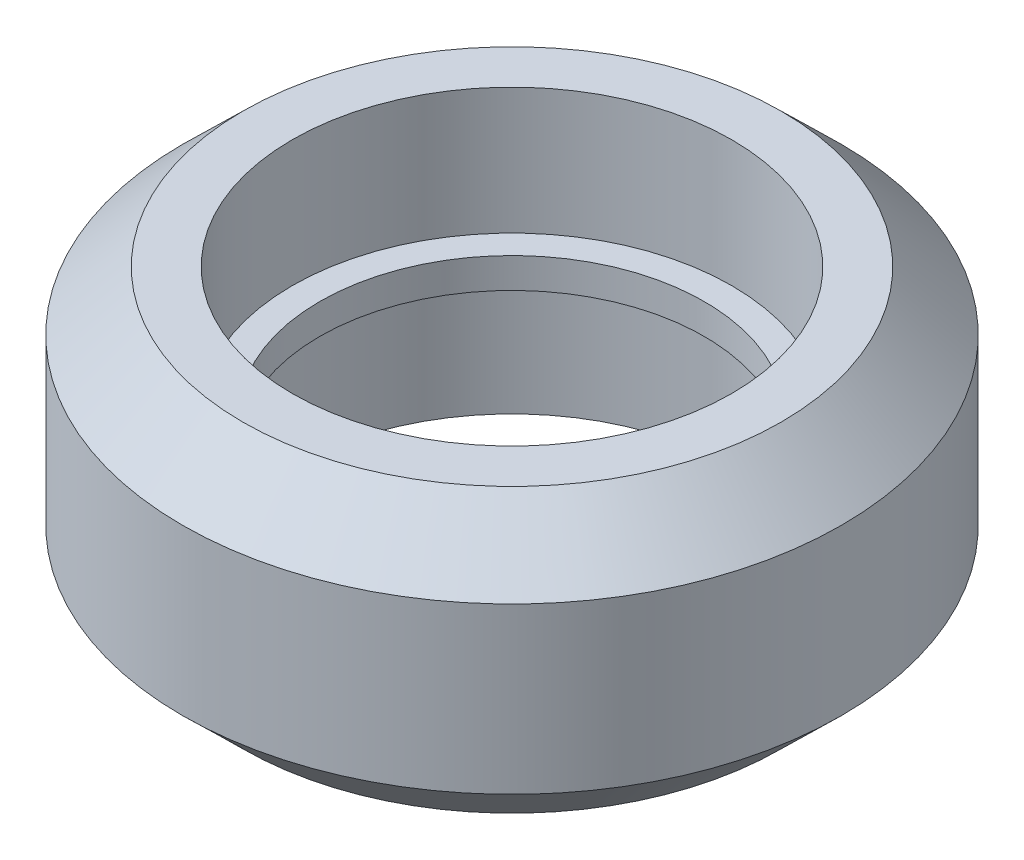
ISO-10303-21;
HEADER;
FILE_DESCRIPTION(('STEP AP214'),'2;1');
FILE_NAME('part.step','',(''),(''),'','','');
FILE_SCHEMA(('AUTOMOTIVE_DESIGN { 1 0 10303 214 1 1 1 1 }'));
ENDSEC;
DATA;
#1=APPLICATION_CONTEXT('core data for automotive mechanical design processes');
#2=APPLICATION_PROTOCOL_DEFINITION('international standard','automotive_design',2000,#1);
#3=PRODUCT_CONTEXT('',#1,'mechanical');
#4=PRODUCT('Part','Part','',(#3));
#5=PRODUCT_RELATED_PRODUCT_CATEGORY('part','',(#4));
#6=PRODUCT_DEFINITION_FORMATION('','',#4);
#7=PRODUCT_DEFINITION_CONTEXT('part definition',#1,'design');
#8=PRODUCT_DEFINITION('design','',#6,#7);
#9=PRODUCT_DEFINITION_SHAPE('','',#8);
#10=(LENGTH_UNIT() NAMED_UNIT(*) SI_UNIT(.MILLI.,.METRE.));
#11=(NAMED_UNIT(*) PLANE_ANGLE_UNIT() SI_UNIT($,.RADIAN.));
#12=(NAMED_UNIT(*) SI_UNIT($,.STERADIAN.) SOLID_ANGLE_UNIT());
#13=UNCERTAINTY_MEASURE_WITH_UNIT(LENGTH_MEASURE(1.E-05),#10,'distance_accuracy_value','');
#14=(GEOMETRIC_REPRESENTATION_CONTEXT(3) GLOBAL_UNCERTAINTY_ASSIGNED_CONTEXT((#13)) GLOBAL_UNIT_ASSIGNED_CONTEXT((#10,
#11,#12)) REPRESENTATION_CONTEXT('',''));
#15=CARTESIAN_POINT('',(0.,0.,0.));
#16=DIRECTION('',(0.,0.,1.));
#17=DIRECTION('',(1.,0.,0.));
#18=AXIS2_PLACEMENT_3D('',#15,#16,#17);
#19=CARTESIAN_POINT('',(6.35888258013483,3.25798729371791,-1.06642978596483));
#20=DIRECTION('',(0.,1.,0.));
#21=DIRECTION('',(1.,0.,0.));
#22=AXIS2_PLACEMENT_3D('',#19,#20,#21);
#23=PLANE('',#22);
#24=CARTESIAN_POINT('',(-1.64111741986517,3.25798729371791,-1.06642978596483));
#25=DIRECTION('',(0.,-1.,0.));
#26=DIRECTION('',(1.,0.,0.));
#27=AXIS2_PLACEMENT_3D('',#24,#25,#26);
#28=CIRCLE('',#27,8.);
#29=CARTESIAN_POINT('',(6.35888258013483,3.25798729371791,-1.06642978596483));
#30=VERTEX_POINT('',#29);
#31=CARTESIAN_POINT('',(-9.64111741986517,3.25798729371791,-1.06642978596483));
#32=VERTEX_POINT('',#31);
#33=EDGE_CURVE('E39',#30,#32,#28,.T.);
#34=ORIENTED_EDGE('',*,*,#33,.F.);
#35=CARTESIAN_POINT('',(-1.64111741986517,3.25798729371791,-1.06642978596483));
#36=DIRECTION('',(0.,-1.,0.));
#37=DIRECTION('',(1.,0.,0.));
#38=AXIS2_PLACEMENT_3D('',#35,#36,#37);
#39=CIRCLE('',#38,8.);
#40=EDGE_CURVE('E164',#32,#30,#39,.T.);
#41=ORIENTED_EDGE('',*,*,#40,.F.);
#42=EDGE_LOOP('',(#34,#41));
#43=FACE_BOUND('',#42,.T.);
#44=CARTESIAN_POINT('',(-1.64111741986517,3.25798729371791,-1.06642978596483));
#45=DIRECTION('',(0.,-1.,0.));
#46=DIRECTION('',(1.,0.,0.));
#47=AXIS2_PLACEMENT_3D('',#44,#45,#46);
#48=CIRCLE('',#47,7.);
#49=CARTESIAN_POINT('',(5.35888258013483,3.25798729371791,-1.06642978596483));
#50=VERTEX_POINT('',#49);
#51=CARTESIAN_POINT('',(-8.64111741986517,3.25798729371791,-1.06642978596483));
#52=VERTEX_POINT('',#51);
#53=EDGE_CURVE('E10',#50,#52,#48,.T.);
#54=ORIENTED_EDGE('',*,*,#53,.T.);
#55=CARTESIAN_POINT('',(-1.64111741986517,3.25798729371791,-1.06642978596483));
#56=DIRECTION('',(0.,-1.,0.));
#57=DIRECTION('',(1.,0.,0.));
#58=AXIS2_PLACEMENT_3D('',#55,#56,#57);
#59=CIRCLE('',#58,7.);
#60=EDGE_CURVE('E26',#52,#50,#59,.T.);
#61=ORIENTED_EDGE('',*,*,#60,.T.);
#62=EDGE_LOOP('',(#54,#61));
#63=FACE_BOUND('',#62,.T.);
#64=ADVANCED_FACE('F16',(#43,#63),#23,.T.);
#65=CARTESIAN_POINT('',(-1.64111741986517,5.55798729371791,-1.06642978596483));
#66=DIRECTION('',(0.,-1.,0.));
#67=DIRECTION('',(1.,0.,0.));
#68=AXIS2_PLACEMENT_3D('',#65,#66,#67);
#69=CYLINDRICAL_SURFACE('',#68,8.);
#70=ORIENTED_EDGE('',*,*,#33,.T.);
#71=DIRECTION('',(0.,1.,0.));
#72=VECTOR('',#71,1.);
#73=CARTESIAN_POINT('',(-9.64111741986517,5.55798729371791,-1.06642978596483));
#74=LINE('',#73,#72);
#75=CARTESIAN_POINT('',(-9.64111741986517,7.85798729371791,-1.06642978596483));
#76=VERTEX_POINT('',#75);
#77=EDGE_CURVE('E167',#32,#76,#74,.T.);
#78=ORIENTED_EDGE('',*,*,#77,.T.);
#79=CARTESIAN_POINT('',(-1.64111741986517,7.85798729371791,-1.06642978596483));
#80=DIRECTION('',(0.,-1.,0.));
#81=DIRECTION('',(1.,0.,0.));
#82=AXIS2_PLACEMENT_3D('',#79,#80,#81);
#83=CIRCLE('',#82,8.);
#84=CARTESIAN_POINT('',(6.35888258013483,7.85798729371791,-1.06642978596483));
#85=VERTEX_POINT('',#84);
#86=EDGE_CURVE('E162',#85,#76,#83,.T.);
#87=ORIENTED_EDGE('',*,*,#86,.F.);
#88=CARTESIAN_POINT('',(-1.64111741986517,7.85798729371791,-1.06642978596483));
#89=DIRECTION('',(0.,-1.,0.));
#90=DIRECTION('',(1.,0.,0.));
#91=AXIS2_PLACEMENT_3D('',#88,#89,#90);
#92=CIRCLE('',#91,8.);
#93=EDGE_CURVE('E165',#76,#85,#92,.T.);
#94=ORIENTED_EDGE('',*,*,#93,.F.);
#95=ORIENTED_EDGE('',*,*,#77,.F.);
#96=ORIENTED_EDGE('',*,*,#40,.T.);
#97=EDGE_LOOP('',(#70,#78,#87,#94,#95,#96));
#98=FACE_BOUND('',#97,.T.);
#99=ADVANCED_FACE('F211',(#98),#69,.F.);
#100=CARTESIAN_POINT('',(8.15888258013483,7.85798729371791,-1.06642978596483));
#101=DIRECTION('',(0.,1.,0.));
#102=DIRECTION('',(1.,0.,0.));
#103=AXIS2_PLACEMENT_3D('',#100,#101,#102);
#104=PLANE('',#103);
#105=CARTESIAN_POINT('',(-1.64111741986517,7.85798729371791,-1.06642978596483));
#106=DIRECTION('',(0.,-1.,0.));
#107=DIRECTION('',(1.,0.,0.));
#108=AXIS2_PLACEMENT_3D('',#105,#106,#107);
#109=CIRCLE('',#108,9.8);
#110=CARTESIAN_POINT('',(8.15888258013483,7.85798729371791,-1.06642978596483));
#111=VERTEX_POINT('',#110);
#112=CARTESIAN_POINT('',(-11.4411174198652,7.85798729371791,-1.06642978596483));
#113=VERTEX_POINT('',#112);
#114=EDGE_CURVE('E150',#111,#113,#109,.T.);
#115=ORIENTED_EDGE('',*,*,#114,.F.);
#116=CARTESIAN_POINT('',(-1.64111741986517,7.85798729371791,-1.06642978596483));
#117=DIRECTION('',(0.,-1.,0.));
#118=DIRECTION('',(1.,0.,0.));
#119=AXIS2_PLACEMENT_3D('',#116,#117,#118);
#120=CIRCLE('',#119,9.8);
#121=EDGE_CURVE('E153',#113,#111,#120,.T.);
#122=ORIENTED_EDGE('',*,*,#121,.F.);
#123=EDGE_LOOP('',(#115,#122));
#124=FACE_BOUND('',#123,.T.);
#125=ORIENTED_EDGE('',*,*,#86,.T.);
#126=ORIENTED_EDGE('',*,*,#93,.T.);
#127=EDGE_LOOP('',(#125,#126));
#128=FACE_BOUND('',#127,.T.);
#129=ADVANCED_FACE('F214',(#124,#128),#104,.T.);
#130=CARTESIAN_POINT('',(-1.64111741986517,6.78298729371791,-1.06642978596483));
#131=DIRECTION('',(0.,-1.,0.));
#132=DIRECTION('',(1.,0.,0.));
#133=AXIS2_PLACEMENT_3D('',#130,#131,#132);
#134=CONICAL_SURFACE('',#133,10.9,0.796891910112479);
#135=CARTESIAN_POINT('',(-1.64111741986517,5.70798729371791,-1.06642978596483));
#136=DIRECTION('',(0.,-1.,0.));
#137=DIRECTION('',(1.,0.,0.));
#138=AXIS2_PLACEMENT_3D('',#135,#136,#137);
#139=CIRCLE('',#138,12.);
#140=CARTESIAN_POINT('',(10.3588825801348,5.70798729371791,-1.06642978596483));
#141=VERTEX_POINT('',#140);
#142=CARTESIAN_POINT('',(-13.6411174198652,5.70798729371791,-1.06642978596483));
#143=VERTEX_POINT('',#142);
#144=EDGE_CURVE('E200',#141,#143,#139,.T.);
#145=ORIENTED_EDGE('',*,*,#144,.F.);
#146=CARTESIAN_POINT('',(-1.64111741986517,5.70798729371791,-1.06642978596483));
#147=DIRECTION('',(0.,-1.,0.));
#148=DIRECTION('',(1.,0.,0.));
#149=AXIS2_PLACEMENT_3D('',#146,#147,#148);
#150=CIRCLE('',#149,12.);
#151=EDGE_CURVE('E19',#143,#141,#150,.T.);
#152=ORIENTED_EDGE('',*,*,#151,.F.);
#153=DIRECTION('',(0.715187202401024,0.698932947801001,0.));
#154=VECTOR('',#153,1.);
#155=CARTESIAN_POINT('',(-12.5411174198652,6.78298729371791,-1.06642978596483));
#156=LINE('',#155,#154);
#157=EDGE_CURVE('E174',#143,#113,#156,.T.);
#158=ORIENTED_EDGE('',*,*,#157,.T.);
#159=ORIENTED_EDGE('',*,*,#121,.T.);
#160=ORIENTED_EDGE('',*,*,#114,.T.);
#161=ORIENTED_EDGE('',*,*,#157,.F.);
#162=EDGE_LOOP('',(#145,#152,#158,#159,#160,#161));
#163=FACE_BOUND('',#162,.T.);
#164=ADVANCED_FACE('F216',(#163),#134,.T.);
#165=CARTESIAN_POINT('',(-1.64111741986517,2.70798729371791,-1.06642978596483));
#166=DIRECTION('',(0.,-1.,0.));
#167=DIRECTION('',(1.,0.,0.));
#168=AXIS2_PLACEMENT_3D('',#165,#166,#167);
#169=CYLINDRICAL_SURFACE('',#168,12.);
#170=CARTESIAN_POINT('',(-1.64111741986517,-0.292012706282094,-1.06642978596483));
#171=DIRECTION('',(0.,-1.,0.));
#172=DIRECTION('',(1.,0.,0.));
#173=AXIS2_PLACEMENT_3D('',#170,#171,#172);
#174=CIRCLE('',#173,12.);
#175=CARTESIAN_POINT('',(10.3588825801348,-0.292012706282094,-1.06642978596483));
#176=VERTEX_POINT('',#175);
#177=CARTESIAN_POINT('',(-13.6411174198652,-0.292012706282094,-1.06642978596483));
#178=VERTEX_POINT('',#177);
#179=EDGE_CURVE('E155',#176,#178,#174,.T.);
#180=ORIENTED_EDGE('',*,*,#179,.F.);
#181=CARTESIAN_POINT('',(-1.64111741986517,-0.292012706282094,-1.06642978596483));
#182=DIRECTION('',(0.,-1.,0.));
#183=DIRECTION('',(1.,0.,0.));
#184=AXIS2_PLACEMENT_3D('',#181,#182,#183);
#185=CIRCLE('',#184,12.);
#186=EDGE_CURVE('E158',#178,#176,#185,.T.);
#187=ORIENTED_EDGE('',*,*,#186,.F.);
#188=DIRECTION('',(0.,1.,0.));
#189=VECTOR('',#188,1.);
#190=CARTESIAN_POINT('',(-13.6411174198652,2.70798729371791,-1.06642978596483));
#191=LINE('',#190,#189);
#192=EDGE_CURVE('E154',#178,#143,#191,.T.);
#193=ORIENTED_EDGE('',*,*,#192,.T.);
#194=ORIENTED_EDGE('',*,*,#151,.T.);
#195=ORIENTED_EDGE('',*,*,#144,.T.);
#196=ORIENTED_EDGE('',*,*,#192,.F.);
#197=EDGE_LOOP('',(#180,#187,#193,#194,#195,#196));
#198=FACE_BOUND('',#197,.T.);
#199=ADVANCED_FACE('F223',(#198),#169,.T.);
#200=CARTESIAN_POINT('',(-1.64111741986517,-1.36701270628209,-1.06642978596483));
#201=DIRECTION('',(0.,1.,0.));
#202=DIRECTION('',(1.,0.,0.));
#203=AXIS2_PLACEMENT_3D('',#200,#201,#202);
#204=CONICAL_SURFACE('',#203,10.9,0.796891910112479);
#205=CARTESIAN_POINT('',(-1.64111741986517,-2.44201270628209,-1.06642978596483));
#206=DIRECTION('',(0.,-1.,0.));
#207=DIRECTION('',(1.,0.,0.));
#208=AXIS2_PLACEMENT_3D('',#205,#206,#207);
#209=CIRCLE('',#208,9.8);
#210=CARTESIAN_POINT('',(8.15888258013483,-2.44201270628209,-1.06642978596483));
#211=VERTEX_POINT('',#210);
#212=CARTESIAN_POINT('',(-11.4411174198652,-2.44201270628209,-1.06642978596483));
#213=VERTEX_POINT('',#212);
#214=EDGE_CURVE('E118',#211,#213,#209,.T.);
#215=ORIENTED_EDGE('',*,*,#214,.F.);
#216=CARTESIAN_POINT('',(-1.64111741986517,-2.44201270628209,-1.06642978596483));
#217=DIRECTION('',(0.,-1.,0.));
#218=DIRECTION('',(1.,0.,0.));
#219=AXIS2_PLACEMENT_3D('',#216,#217,#218);
#220=CIRCLE('',#219,9.8);
#221=EDGE_CURVE('E122',#213,#211,#220,.T.);
#222=ORIENTED_EDGE('',*,*,#221,.F.);
#223=DIRECTION('',(-0.715187202401024,0.698932947801001,0.));
#224=VECTOR('',#223,1.);
#225=CARTESIAN_POINT('',(-12.5411174198652,-1.36701270628209,-1.06642978596483));
#226=LINE('',#225,#224);
#227=EDGE_CURVE('E178',#213,#178,#226,.T.);
#228=ORIENTED_EDGE('',*,*,#227,.T.);
#229=ORIENTED_EDGE('',*,*,#186,.T.);
#230=ORIENTED_EDGE('',*,*,#179,.T.);
#231=ORIENTED_EDGE('',*,*,#227,.F.);
#232=EDGE_LOOP('',(#215,#222,#228,#229,#230,#231));
#233=FACE_BOUND('',#232,.T.);
#234=ADVANCED_FACE('F247',(#233),#204,.T.);
#235=CARTESIAN_POINT('',(6.35888258013483,-2.44201270628209,-1.06642978596483));
#236=DIRECTION('',(0.,-1.,0.));
#237=DIRECTION('',(0.,0.,-1.));
#238=AXIS2_PLACEMENT_3D('',#235,#236,#237);
#239=PLANE('',#238);
#240=ORIENTED_EDGE('',*,*,#214,.T.);
#241=ORIENTED_EDGE('',*,*,#221,.T.);
#242=EDGE_LOOP('',(#240,#241));
#243=FACE_BOUND('',#242,.T.);
#244=CARTESIAN_POINT('',(-1.64111741986517,-2.44201270628209,-1.06642978596483));
#245=DIRECTION('',(0.,-1.,0.));
#246=DIRECTION('',(1.,0.,0.));
#247=AXIS2_PLACEMENT_3D('',#244,#245,#246);
#248=CIRCLE('',#247,8.);
#249=CARTESIAN_POINT('',(6.35888258013483,-2.44201270628209,-1.06642978596483));
#250=VERTEX_POINT('',#249);
#251=CARTESIAN_POINT('',(-9.64111741986517,-2.44201270628209,-1.06642978596483));
#252=VERTEX_POINT('',#251);
#253=EDGE_CURVE('E128',#250,#252,#248,.T.);
#254=ORIENTED_EDGE('',*,*,#253,.F.);
#255=CARTESIAN_POINT('',(-1.64111741986517,-2.44201270628209,-1.06642978596483));
#256=DIRECTION('',(0.,-1.,0.));
#257=DIRECTION('',(1.,0.,0.));
#258=AXIS2_PLACEMENT_3D('',#255,#256,#257);
#259=CIRCLE('',#258,8.);
#260=EDGE_CURVE('E131',#252,#250,#259,.T.);
#261=ORIENTED_EDGE('',*,*,#260,.F.);
#262=EDGE_LOOP('',(#254,#261));
#263=FACE_BOUND('',#262,.T.);
#264=ADVANCED_FACE('F130',(#243,#263),#239,.T.);
#265=CARTESIAN_POINT('',(-1.64111741986517,-0.142012706282094,-1.06642978596483));
#266=DIRECTION('',(0.,-1.,0.));
#267=DIRECTION('',(1.,0.,0.));
#268=AXIS2_PLACEMENT_3D('',#265,#266,#267);
#269=CYLINDRICAL_SURFACE('',#268,8.);
#270=ORIENTED_EDGE('',*,*,#253,.T.);
#271=DIRECTION('',(0.,1.,0.));
#272=VECTOR('',#271,1.);
#273=CARTESIAN_POINT('',(-9.64111741986517,-0.142012706282094,-1.06642978596483));
#274=LINE('',#273,#272);
#275=CARTESIAN_POINT('',(-9.64111741986517,2.15798729371791,-1.06642978596483));
#276=VERTEX_POINT('',#275);
#277=EDGE_CURVE('E134',#252,#276,#274,.T.);
#278=ORIENTED_EDGE('',*,*,#277,.T.);
#279=CARTESIAN_POINT('',(-1.64111741986517,2.15798729371791,-1.06642978596483));
#280=DIRECTION('',(0.,-1.,0.));
#281=DIRECTION('',(1.,0.,0.));
#282=AXIS2_PLACEMENT_3D('',#279,#280,#281);
#283=CIRCLE('',#282,8.);
#284=CARTESIAN_POINT('',(6.35888258013483,2.15798729371791,-1.06642978596483));
#285=VERTEX_POINT('',#284);
#286=EDGE_CURVE('E102',#285,#276,#283,.T.);
#287=ORIENTED_EDGE('',*,*,#286,.F.);
#288=CARTESIAN_POINT('',(-1.64111741986517,2.15798729371791,-1.06642978596483));
#289=DIRECTION('',(0.,-1.,0.));
#290=DIRECTION('',(1.,0.,0.));
#291=AXIS2_PLACEMENT_3D('',#288,#289,#290);
#292=CIRCLE('',#291,8.);
#293=EDGE_CURVE('E145',#276,#285,#292,.T.);
#294=ORIENTED_EDGE('',*,*,#293,.F.);
#295=ORIENTED_EDGE('',*,*,#277,.F.);
#296=ORIENTED_EDGE('',*,*,#260,.T.);
#297=EDGE_LOOP('',(#270,#278,#287,#294,#295,#296));
#298=FACE_BOUND('',#297,.T.);
#299=ADVANCED_FACE('F136',(#298),#269,.F.);
#300=CARTESIAN_POINT('',(5.35888258013483,2.15798729371791,-1.06642978596483));
#301=DIRECTION('',(0.,-1.,0.));
#302=DIRECTION('',(0.,0.,-1.));
#303=AXIS2_PLACEMENT_3D('',#300,#301,#302);
#304=PLANE('',#303);
#305=ORIENTED_EDGE('',*,*,#286,.T.);
#306=ORIENTED_EDGE('',*,*,#293,.T.);
#307=EDGE_LOOP('',(#305,#306));
#308=FACE_BOUND('',#307,.T.);
#309=CARTESIAN_POINT('',(-1.64111741986517,2.15798729371791,-1.06642978596483));
#310=DIRECTION('',(0.,-1.,0.));
#311=DIRECTION('',(1.,0.,0.));
#312=AXIS2_PLACEMENT_3D('',#309,#310,#311);
#313=CIRCLE('',#312,7.);
#314=CARTESIAN_POINT('',(5.35888258013483,2.15798729371791,-1.06642978596483));
#315=VERTEX_POINT('',#314);
#316=CARTESIAN_POINT('',(-8.64111741986517,2.15798729371791,-1.06642978596483));
#317=VERTEX_POINT('',#316);
#318=EDGE_CURVE('E187',#315,#317,#313,.T.);
#319=ORIENTED_EDGE('',*,*,#318,.F.);
#320=CARTESIAN_POINT('',(-1.64111741986517,2.15798729371791,-1.06642978596483));
#321=DIRECTION('',(0.,-1.,0.));
#322=DIRECTION('',(1.,0.,0.));
#323=AXIS2_PLACEMENT_3D('',#320,#321,#322);
#324=CIRCLE('',#323,7.);
#325=EDGE_CURVE('E192',#317,#315,#324,.T.);
#326=ORIENTED_EDGE('',*,*,#325,.F.);
#327=EDGE_LOOP('',(#319,#326));
#328=FACE_BOUND('',#327,.T.);
#329=ADVANCED_FACE('F237',(#308,#328),#304,.T.);
#330=CARTESIAN_POINT('',(-1.64111741986517,2.70798729371791,-1.06642978596483));
#331=DIRECTION('',(0.,-1.,0.));
#332=DIRECTION('',(1.,0.,0.));
#333=AXIS2_PLACEMENT_3D('',#330,#331,#332);
#334=CYLINDRICAL_SURFACE('',#333,7.);
#335=ORIENTED_EDGE('',*,*,#318,.T.);
#336=DIRECTION('',(0.,1.,0.));
#337=VECTOR('',#336,1.);
#338=CARTESIAN_POINT('',(-8.64111741986517,2.70798729371791,-1.06642978596483));
#339=LINE('',#338,#337);
#340=EDGE_CURVE('E191',#317,#52,#339,.T.);
#341=ORIENTED_EDGE('',*,*,#340,.T.);
#342=ORIENTED_EDGE('',*,*,#53,.F.);
#343=ORIENTED_EDGE('',*,*,#60,.F.);
#344=ORIENTED_EDGE('',*,*,#340,.F.);
#345=ORIENTED_EDGE('',*,*,#325,.T.);
#346=EDGE_LOOP('',(#335,#341,#342,#343,#344,#345));
#347=FACE_BOUND('',#346,.T.);
#348=ADVANCED_FACE('F235',(#347),#334,.F.);
#349=CLOSED_SHELL('',(#64,#99,#129,#164,#199,#234,#264,#299,#329,#348));
#350=MANIFOLD_SOLID_BREP('B1',#349);
#351=ADVANCED_BREP_SHAPE_REPRESENTATION('',(#18,#350),#14);
#352=SHAPE_DEFINITION_REPRESENTATION(#9,#351);
ENDSEC;
END-ISO-10303-21;
